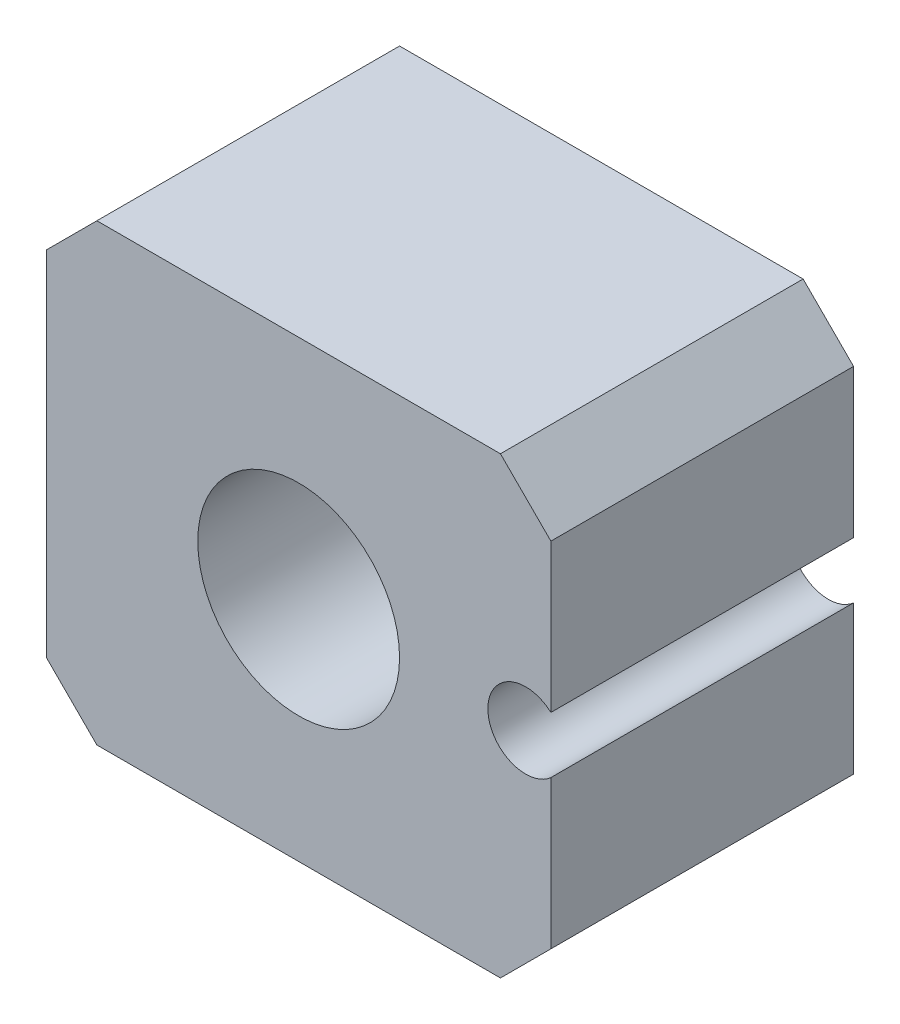
ISO-10303-21;
HEADER;
FILE_DESCRIPTION(('STEP AP214'),'2;1');
FILE_NAME('part.step','',(''),(''),'','','');
FILE_SCHEMA(('AUTOMOTIVE_DESIGN { 1 0 10303 214 1 1 1 1 }'));
ENDSEC;
DATA;
#1=APPLICATION_CONTEXT('core data for automotive mechanical design processes');
#2=APPLICATION_PROTOCOL_DEFINITION('international standard','automotive_design',2000,#1);
#3=PRODUCT_CONTEXT('',#1,'mechanical');
#4=PRODUCT('Part','Part','',(#3));
#5=PRODUCT_RELATED_PRODUCT_CATEGORY('part','',(#4));
#6=PRODUCT_DEFINITION_FORMATION('','',#4);
#7=PRODUCT_DEFINITION_CONTEXT('part definition',#1,'design');
#8=PRODUCT_DEFINITION('design','',#6,#7);
#9=PRODUCT_DEFINITION_SHAPE('','',#8);
#10=(LENGTH_UNIT() NAMED_UNIT(*) SI_UNIT(.MILLI.,.METRE.));
#11=(NAMED_UNIT(*) PLANE_ANGLE_UNIT() SI_UNIT($,.RADIAN.));
#12=(NAMED_UNIT(*) SI_UNIT($,.STERADIAN.) SOLID_ANGLE_UNIT());
#13=UNCERTAINTY_MEASURE_WITH_UNIT(LENGTH_MEASURE(1.E-05),#10,'distance_accuracy_value','');
#14=(GEOMETRIC_REPRESENTATION_CONTEXT(3) GLOBAL_UNCERTAINTY_ASSIGNED_CONTEXT((#13)) GLOBAL_UNIT_ASSIGNED_CONTEXT((#10,
#11,#12)) REPRESENTATION_CONTEXT('',''));
#15=CARTESIAN_POINT('',(0.,0.,0.));
#16=DIRECTION('',(0.,0.,1.));
#17=DIRECTION('',(1.,0.,0.));
#18=AXIS2_PLACEMENT_3D('',#15,#16,#17);
#19=CARTESIAN_POINT('',(10.,9.,12.));
#20=DIRECTION('',(-1.,0.,0.));
#21=DIRECTION('',(0.,-1.,0.));
#22=AXIS2_PLACEMENT_3D('',#19,#20,#21);
#23=PLANE('',#22);
#24=DIRECTION('',(0.,1.,0.));
#25=VECTOR('',#24,1.);
#26=CARTESIAN_POINT('',(10.,9.,12.));
#27=LINE('',#26,#25);
#28=CARTESIAN_POINT('',(10.,-7.,12.));
#29=VERTEX_POINT('',#28);
#30=CARTESIAN_POINT('',(10.,-1.11803398874989,12.));
#31=VERTEX_POINT('',#30);
#32=EDGE_CURVE('E147',#29,#31,#27,.T.);
#33=ORIENTED_EDGE('',*,*,#32,.F.);
#34=DIRECTION('',(0.,0.,-1.));
#35=VECTOR('',#34,1.);
#36=CARTESIAN_POINT('',(10.,-7.,12.));
#37=LINE('',#36,#35);
#38=CARTESIAN_POINT('',(10.,-7.,0.));
#39=VERTEX_POINT('',#38);
#40=EDGE_CURVE('E40',#29,#39,#37,.T.);
#41=ORIENTED_EDGE('',*,*,#40,.T.);
#42=DIRECTION('',(0.,1.,0.));
#43=VECTOR('',#42,1.);
#44=CARTESIAN_POINT('',(10.,9.,0.));
#45=LINE('',#44,#43);
#46=CARTESIAN_POINT('',(10.,-1.11803398874989,0.));
#47=VERTEX_POINT('',#46);
#48=EDGE_CURVE('E136',#39,#47,#45,.T.);
#49=ORIENTED_EDGE('',*,*,#48,.T.);
#50=DIRECTION('',(0.,0.,1.));
#51=VECTOR('',#50,1.);
#52=CARTESIAN_POINT('',(10.,-1.11803398874989,0.));
#53=LINE('',#52,#51);
#54=EDGE_CURVE('E117',#47,#31,#53,.T.);
#55=ORIENTED_EDGE('',*,*,#54,.T.);
#56=EDGE_LOOP('',(#33,#41,#49,#55));
#57=FACE_BOUND('',#56,.T.);
#58=ADVANCED_FACE('F32',(#57),#23,.F.);
#59=CARTESIAN_POINT('',(-10.,9.,12.));
#60=DIRECTION('',(0.,-1.,0.));
#61=DIRECTION('',(0.,0.,-1.));
#62=AXIS2_PLACEMENT_3D('',#59,#60,#61);
#63=PLANE('',#62);
#64=DIRECTION('',(-1.,0.,0.));
#65=VECTOR('',#64,1.);
#66=CARTESIAN_POINT('',(-10.,9.,0.));
#67=LINE('',#66,#65);
#68=CARTESIAN_POINT('',(8.,9.,0.));
#69=VERTEX_POINT('',#68);
#70=CARTESIAN_POINT('',(-7.99999999999999,9.,0.));
#71=VERTEX_POINT('',#70);
#72=EDGE_CURVE('E191',#69,#71,#67,.T.);
#73=ORIENTED_EDGE('',*,*,#72,.T.);
#74=DIRECTION('',(0.,0.,1.));
#75=VECTOR('',#74,1.);
#76=CARTESIAN_POINT('',(-7.99999999999999,9.,12.));
#77=LINE('',#76,#75);
#78=CARTESIAN_POINT('',(-7.99999999999999,9.,12.));
#79=VERTEX_POINT('',#78);
#80=EDGE_CURVE('E160',#71,#79,#77,.T.);
#81=ORIENTED_EDGE('',*,*,#80,.T.);
#82=DIRECTION('',(-1.,0.,0.));
#83=VECTOR('',#82,1.);
#84=CARTESIAN_POINT('',(-10.,9.,12.));
#85=LINE('',#84,#83);
#86=CARTESIAN_POINT('',(8.,9.,12.));
#87=VERTEX_POINT('',#86);
#88=EDGE_CURVE('E139',#87,#79,#85,.T.);
#89=ORIENTED_EDGE('',*,*,#88,.F.);
#90=DIRECTION('',(0.,0.,-1.));
#91=VECTOR('',#90,1.);
#92=CARTESIAN_POINT('',(8.,9.,12.));
#93=LINE('',#92,#91);
#94=EDGE_CURVE('E157',#87,#69,#93,.T.);
#95=ORIENTED_EDGE('',*,*,#94,.T.);
#96=EDGE_LOOP('',(#73,#81,#89,#95));
#97=FACE_BOUND('',#96,.T.);
#98=ADVANCED_FACE('F212',(#97),#63,.F.);
#99=CARTESIAN_POINT('',(-10.,9.,12.));
#100=DIRECTION('',(1.,0.,0.));
#101=DIRECTION('',(0.,1.,0.));
#102=AXIS2_PLACEMENT_3D('',#99,#100,#101);
#103=PLANE('',#102);
#104=DIRECTION('',(0.,-1.,0.));
#105=VECTOR('',#104,1.);
#106=CARTESIAN_POINT('',(-10.,9.,12.));
#107=LINE('',#106,#105);
#108=CARTESIAN_POINT('',(-10.,7.,12.));
#109=VERTEX_POINT('',#108);
#110=CARTESIAN_POINT('',(-10.,-6.99999999999998,12.));
#111=VERTEX_POINT('',#110);
#112=EDGE_CURVE('E185',#109,#111,#107,.T.);
#113=ORIENTED_EDGE('',*,*,#112,.F.);
#114=DIRECTION('',(0.,0.,-1.));
#115=VECTOR('',#114,1.);
#116=CARTESIAN_POINT('',(-10.,7.,12.));
#117=LINE('',#116,#115);
#118=CARTESIAN_POINT('',(-10.,7.,0.));
#119=VERTEX_POINT('',#118);
#120=EDGE_CURVE('E146',#109,#119,#117,.T.);
#121=ORIENTED_EDGE('',*,*,#120,.T.);
#122=DIRECTION('',(0.,-1.,0.));
#123=VECTOR('',#122,1.);
#124=CARTESIAN_POINT('',(-10.,9.,0.));
#125=LINE('',#124,#123);
#126=CARTESIAN_POINT('',(-10.,-6.99999999999999,0.));
#127=VERTEX_POINT('',#126);
#128=EDGE_CURVE('E140',#119,#127,#125,.T.);
#129=ORIENTED_EDGE('',*,*,#128,.T.);
#130=DIRECTION('',(0.,0.,1.));
#131=VECTOR('',#130,1.);
#132=CARTESIAN_POINT('',(-10.,-6.99999999999999,12.));
#133=LINE('',#132,#131);
#134=EDGE_CURVE('E144',#127,#111,#133,.T.);
#135=ORIENTED_EDGE('',*,*,#134,.T.);
#136=EDGE_LOOP('',(#113,#121,#129,#135));
#137=FACE_BOUND('',#136,.T.);
#138=ADVANCED_FACE('F197',(#137),#103,.F.);
#139=CARTESIAN_POINT('',(-10.,-9.,12.));
#140=DIRECTION('',(0.,1.,0.));
#141=DIRECTION('',(0.,0.,1.));
#142=AXIS2_PLACEMENT_3D('',#139,#140,#141);
#143=PLANE('',#142);
#144=DIRECTION('',(1.,0.,0.));
#145=VECTOR('',#144,1.);
#146=CARTESIAN_POINT('',(-10.,-9.,12.));
#147=LINE('',#146,#145);
#148=CARTESIAN_POINT('',(-7.99999999999999,-9.,12.));
#149=VERTEX_POINT('',#148);
#150=CARTESIAN_POINT('',(7.99999999999999,-9.,12.));
#151=VERTEX_POINT('',#150);
#152=EDGE_CURVE('E184',#149,#151,#147,.T.);
#153=ORIENTED_EDGE('',*,*,#152,.F.);
#154=DIRECTION('',(0.,0.,-1.));
#155=VECTOR('',#154,1.);
#156=CARTESIAN_POINT('',(-7.99999999999999,-9.,12.));
#157=LINE('',#156,#155);
#158=CARTESIAN_POINT('',(-8.,-9.,0.));
#159=VERTEX_POINT('',#158);
#160=EDGE_CURVE('E170',#149,#159,#157,.T.);
#161=ORIENTED_EDGE('',*,*,#160,.T.);
#162=DIRECTION('',(1.,0.,0.));
#163=VECTOR('',#162,1.);
#164=CARTESIAN_POINT('',(-10.,-9.,0.));
#165=LINE('',#164,#163);
#166=CARTESIAN_POINT('',(7.99999999999999,-9.,0.));
#167=VERTEX_POINT('',#166);
#168=EDGE_CURVE('E137',#159,#167,#165,.T.);
#169=ORIENTED_EDGE('',*,*,#168,.T.);
#170=DIRECTION('',(0.,0.,1.));
#171=VECTOR('',#170,1.);
#172=CARTESIAN_POINT('',(7.99999999999999,-9.,12.));
#173=LINE('',#172,#171);
#174=EDGE_CURVE('E47',#167,#151,#173,.T.);
#175=ORIENTED_EDGE('',*,*,#174,.T.);
#176=EDGE_LOOP('',(#153,#161,#169,#175));
#177=FACE_BOUND('',#176,.T.);
#178=ADVANCED_FACE('F179',(#177),#143,.F.);
#179=CARTESIAN_POINT('',(10.,1.11803398874989,0.));
#180=VERTEX_POINT('',#179);
#181=CARTESIAN_POINT('',(10.,6.99999999999999,0.));
#182=VERTEX_POINT('',#181);
#183=EDGE_CURVE('E127',#180,#182,#45,.T.);
#184=ORIENTED_EDGE('',*,*,#183,.T.);
#185=DIRECTION('',(0.,0.,1.));
#186=VECTOR('',#185,1.);
#187=CARTESIAN_POINT('',(10.,6.99999999999999,12.));
#188=LINE('',#187,#186);
#189=CARTESIAN_POINT('',(10.,6.99999999999999,12.));
#190=VERTEX_POINT('',#189);
#191=EDGE_CURVE('E11',#182,#190,#188,.T.);
#192=ORIENTED_EDGE('',*,*,#191,.T.);
#193=CARTESIAN_POINT('',(10.,1.11803398874989,12.));
#194=VERTEX_POINT('',#193);
#195=EDGE_CURVE('E130',#194,#190,#27,.T.);
#196=ORIENTED_EDGE('',*,*,#195,.F.);
#197=DIRECTION('',(0.,0.,1.));
#198=VECTOR('',#197,1.);
#199=CARTESIAN_POINT('',(10.,1.11803398874989,0.));
#200=LINE('',#199,#198);
#201=EDGE_CURVE('E114',#194,#180,#200,.F.);
#202=ORIENTED_EDGE('',*,*,#201,.T.);
#203=EDGE_LOOP('',(#184,#192,#196,#202));
#204=FACE_BOUND('',#203,.T.);
#205=ADVANCED_FACE('F126',(#204),#23,.F.);
#206=CARTESIAN_POINT('',(0.,0.,12.));
#207=DIRECTION('',(0.,0.,-1.));
#208=DIRECTION('',(-1.,0.,0.));
#209=AXIS2_PLACEMENT_3D('',#206,#207,#208);
#210=PLANE('',#209);
#211=CARTESIAN_POINT('',(0.,0.,12.));
#212=DIRECTION('',(0.,0.,1.));
#213=DIRECTION('',(1.,0.,0.));
#214=AXIS2_PLACEMENT_3D('',#211,#212,#213);
#215=CIRCLE('',#214,4.);
#216=CARTESIAN_POINT('',(4.,0.,12.));
#217=VERTEX_POINT('',#216);
#218=EDGE_CURVE('E320',#217,#217,#215,.T.);
#219=ORIENTED_EDGE('',*,*,#218,.F.);
#220=EDGE_LOOP('',(#219));
#221=FACE_BOUND('',#220,.T.);
#222=ORIENTED_EDGE('',*,*,#88,.T.);
#223=DIRECTION('',(0.707106781186549,0.707106781186546,0.));
#224=VECTOR('',#223,1.);
#225=CARTESIAN_POINT('',(-10.,7.,12.));
#226=LINE('',#225,#224);
#227=EDGE_CURVE('E167',#79,#109,#226,.F.);
#228=ORIENTED_EDGE('',*,*,#227,.T.);
#229=ORIENTED_EDGE('',*,*,#112,.T.);
#230=DIRECTION('',(-0.707106781186546,0.707106781186549,0.));
#231=VECTOR('',#230,1.);
#232=CARTESIAN_POINT('',(-7.99999999999999,-9.,12.));
#233=LINE('',#232,#231);
#234=EDGE_CURVE('E54',#111,#149,#233,.F.);
#235=ORIENTED_EDGE('',*,*,#234,.T.);
#236=ORIENTED_EDGE('',*,*,#152,.T.);
#237=DIRECTION('',(-0.707106781186549,-0.707106781186546,0.));
#238=VECTOR('',#237,1.);
#239=CARTESIAN_POINT('',(10.,-7.,12.));
#240=LINE('',#239,#238);
#241=EDGE_CURVE('E164',#151,#29,#240,.F.);
#242=ORIENTED_EDGE('',*,*,#241,.T.);
#243=ORIENTED_EDGE('',*,*,#32,.T.);
#244=CARTESIAN_POINT('',(8.99999999999999,0.,12.));
#245=DIRECTION('',(0.,0.,1.));
#246=DIRECTION('',(1.,0.,0.));
#247=AXIS2_PLACEMENT_3D('',#244,#245,#246);
#248=CIRCLE('',#247,1.5);
#249=EDGE_CURVE('E121',#194,#31,#248,.T.);
#250=ORIENTED_EDGE('',*,*,#249,.F.);
#251=ORIENTED_EDGE('',*,*,#195,.T.);
#252=DIRECTION('',(0.707106781186546,-0.707106781186549,0.));
#253=VECTOR('',#252,1.);
#254=CARTESIAN_POINT('',(8.,9.,12.));
#255=LINE('',#254,#253);
#256=EDGE_CURVE('E162',#190,#87,#255,.F.);
#257=ORIENTED_EDGE('',*,*,#256,.T.);
#258=EDGE_LOOP('',(#222,#228,#229,#235,#236,#242,#243,#250,#251,#257));
#259=FACE_BOUND('',#258,.T.);
#260=ADVANCED_FACE('F183',(#221,#259),#210,.F.);
#261=CARTESIAN_POINT('',(0.,0.,0.));
#262=DIRECTION('',(0.,0.,-1.));
#263=DIRECTION('',(-1.,0.,0.));
#264=AXIS2_PLACEMENT_3D('',#261,#262,#263);
#265=PLANE('',#264);
#266=CARTESIAN_POINT('',(0.,0.,0.));
#267=DIRECTION('',(0.,0.,1.));
#268=DIRECTION('',(1.,0.,0.));
#269=AXIS2_PLACEMENT_3D('',#266,#267,#268);
#270=CIRCLE('',#269,4.);
#271=CARTESIAN_POINT('',(4.,0.,0.));
#272=VERTEX_POINT('',#271);
#273=EDGE_CURVE('E318',#272,#272,#270,.T.);
#274=ORIENTED_EDGE('',*,*,#273,.T.);
#275=EDGE_LOOP('',(#274));
#276=FACE_BOUND('',#275,.T.);
#277=ORIENTED_EDGE('',*,*,#128,.F.);
#278=DIRECTION('',(-0.707106781186549,-0.707106781186546,0.));
#279=VECTOR('',#278,1.);
#280=CARTESIAN_POINT('',(-8.49999999999998,8.50000000000001,0.));
#281=LINE('',#280,#279);
#282=EDGE_CURVE('E155',#119,#71,#281,.F.);
#283=ORIENTED_EDGE('',*,*,#282,.T.);
#284=ORIENTED_EDGE('',*,*,#72,.F.);
#285=DIRECTION('',(-0.707106781186546,0.707106781186549,0.));
#286=VECTOR('',#285,1.);
#287=CARTESIAN_POINT('',(8.50000000000001,8.49999999999999,0.));
#288=LINE('',#287,#286);
#289=EDGE_CURVE('E135',#69,#182,#288,.F.);
#290=ORIENTED_EDGE('',*,*,#289,.T.);
#291=ORIENTED_EDGE('',*,*,#183,.F.);
#292=CARTESIAN_POINT('',(8.99999999999999,0.,0.));
#293=DIRECTION('',(0.,0.,1.));
#294=DIRECTION('',(1.,0.,0.));
#295=AXIS2_PLACEMENT_3D('',#292,#293,#294);
#296=CIRCLE('',#295,1.5);
#297=EDGE_CURVE('E110',#180,#47,#296,.T.);
#298=ORIENTED_EDGE('',*,*,#297,.T.);
#299=ORIENTED_EDGE('',*,*,#48,.F.);
#300=DIRECTION('',(0.707106781186549,0.707106781186546,0.));
#301=VECTOR('',#300,1.);
#302=CARTESIAN_POINT('',(8.49999999999998,-8.50000000000001,0.));
#303=LINE('',#302,#301);
#304=EDGE_CURVE('E151',#39,#167,#303,.F.);
#305=ORIENTED_EDGE('',*,*,#304,.T.);
#306=ORIENTED_EDGE('',*,*,#168,.F.);
#307=DIRECTION('',(0.707106781186546,-0.707106781186549,0.));
#308=VECTOR('',#307,1.);
#309=CARTESIAN_POINT('',(-8.50000000000001,-8.49999999999998,0.));
#310=LINE('',#309,#308);
#311=EDGE_CURVE('E153',#159,#127,#310,.F.);
#312=ORIENTED_EDGE('',*,*,#311,.T.);
#313=EDGE_LOOP('',(#277,#283,#284,#290,#291,#298,#299,#305,#306,#312));
#314=FACE_BOUND('',#313,.T.);
#315=ADVANCED_FACE('F133',(#276,#314),#265,.T.);
#316=CARTESIAN_POINT('',(8.99999999999999,0.,0.));
#317=DIRECTION('',(0.,0.,1.));
#318=DIRECTION('',(1.,0.,0.));
#319=AXIS2_PLACEMENT_3D('',#316,#317,#318);
#320=CYLINDRICAL_SURFACE('',#319,1.5);
#321=ORIENTED_EDGE('',*,*,#297,.F.);
#322=ORIENTED_EDGE('',*,*,#201,.F.);
#323=ORIENTED_EDGE('',*,*,#249,.T.);
#324=ORIENTED_EDGE('',*,*,#54,.F.);
#325=EDGE_LOOP('',(#321,#322,#323,#324));
#326=FACE_BOUND('',#325,.T.);
#327=ADVANCED_FACE('F112',(#326),#320,.F.);
#328=CARTESIAN_POINT('',(0.,0.,0.));
#329=DIRECTION('',(0.,0.,1.));
#330=DIRECTION('',(1.,0.,0.));
#331=AXIS2_PLACEMENT_3D('',#328,#329,#330);
#332=CYLINDRICAL_SURFACE('',#331,4.);
#333=ORIENTED_EDGE('',*,*,#273,.F.);
#334=EDGE_LOOP('',(#333));
#335=FACE_BOUND('',#334,.T.);
#336=ORIENTED_EDGE('',*,*,#218,.T.);
#337=EDGE_LOOP('',(#336));
#338=FACE_BOUND('',#337,.T.);
#339=ADVANCED_FACE('F208',(#335,#338),#332,.F.);
#340=CARTESIAN_POINT('',(-10.,7.,12.));
#341=DIRECTION('',(0.707106781186546,-0.707106781186549,0.));
#342=DIRECTION('',(0.,0.,-1.));
#343=AXIS2_PLACEMENT_3D('',#340,#341,#342);
#344=PLANE('',#343);
#345=ORIENTED_EDGE('',*,*,#227,.F.);
#346=ORIENTED_EDGE('',*,*,#80,.F.);
#347=ORIENTED_EDGE('',*,*,#282,.F.);
#348=ORIENTED_EDGE('',*,*,#120,.F.);
#349=EDGE_LOOP('',(#345,#346,#347,#348));
#350=FACE_BOUND('',#349,.T.);
#351=ADVANCED_FACE('F202',(#350),#344,.F.);
#352=CARTESIAN_POINT('',(-7.99999999999999,-9.,12.));
#353=DIRECTION('',(0.707106781186549,0.707106781186546,0.));
#354=DIRECTION('',(0.,0.,-1.));
#355=AXIS2_PLACEMENT_3D('',#352,#353,#354);
#356=PLANE('',#355);
#357=ORIENTED_EDGE('',*,*,#234,.F.);
#358=ORIENTED_EDGE('',*,*,#134,.F.);
#359=ORIENTED_EDGE('',*,*,#311,.F.);
#360=ORIENTED_EDGE('',*,*,#160,.F.);
#361=EDGE_LOOP('',(#357,#358,#359,#360));
#362=FACE_BOUND('',#361,.T.);
#363=ADVANCED_FACE('F200',(#362),#356,.F.);
#364=CARTESIAN_POINT('',(10.,-7.,12.));
#365=DIRECTION('',(-0.707106781186546,0.707106781186549,0.));
#366=DIRECTION('',(0.,0.,-1.));
#367=AXIS2_PLACEMENT_3D('',#364,#365,#366);
#368=PLANE('',#367);
#369=ORIENTED_EDGE('',*,*,#241,.F.);
#370=ORIENTED_EDGE('',*,*,#174,.F.);
#371=ORIENTED_EDGE('',*,*,#304,.F.);
#372=ORIENTED_EDGE('',*,*,#40,.F.);
#373=EDGE_LOOP('',(#369,#370,#371,#372));
#374=FACE_BOUND('',#373,.T.);
#375=ADVANCED_FACE('F181',(#374),#368,.F.);
#376=CARTESIAN_POINT('',(8.,9.,12.));
#377=DIRECTION('',(-0.707106781186549,-0.707106781186546,0.));
#378=DIRECTION('',(0.,0.,-1.));
#379=AXIS2_PLACEMENT_3D('',#376,#377,#378);
#380=PLANE('',#379);
#381=ORIENTED_EDGE('',*,*,#256,.F.);
#382=ORIENTED_EDGE('',*,*,#191,.F.);
#383=ORIENTED_EDGE('',*,*,#289,.F.);
#384=ORIENTED_EDGE('',*,*,#94,.F.);
#385=EDGE_LOOP('',(#381,#382,#383,#384));
#386=FACE_BOUND('',#385,.T.);
#387=ADVANCED_FACE('F34',(#386),#380,.F.);
#388=CLOSED_SHELL('',(#58,#98,#138,#178,#205,#260,#315,#327,#339,#351,#363,#375,#387));
#389=MANIFOLD_SOLID_BREP('B2',#388);
#390=ADVANCED_BREP_SHAPE_REPRESENTATION('',(#18,#389),#14);
#391=SHAPE_DEFINITION_REPRESENTATION(#9,#390);
ENDSEC;
END-ISO-10303-21;
